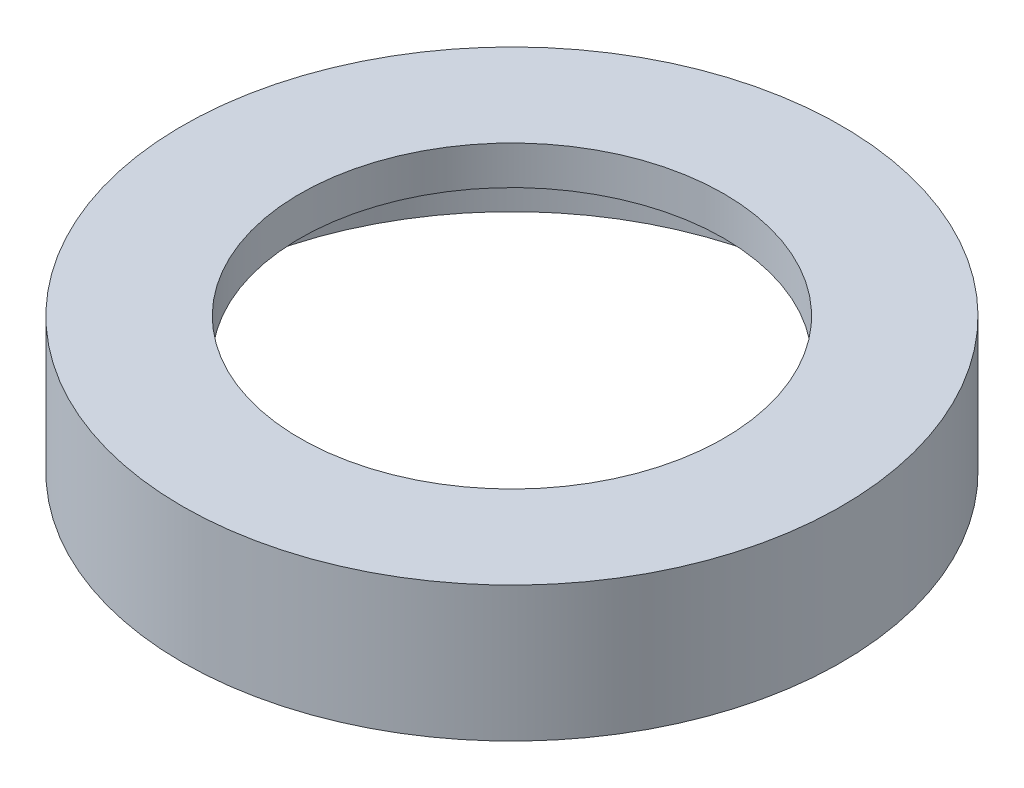
ISO-10303-21;
HEADER;
FILE_DESCRIPTION(('STEP AP214'),'2;1');
FILE_NAME('part.step','',(''),(''),'','','');
FILE_SCHEMA(('AUTOMOTIVE_DESIGN { 1 0 10303 214 1 1 1 1 }'));
ENDSEC;
DATA;
#1=APPLICATION_CONTEXT('core data for automotive mechanical design processes');
#2=APPLICATION_PROTOCOL_DEFINITION('international standard','automotive_design',2000,#1);
#3=PRODUCT_CONTEXT('',#1,'mechanical');
#4=PRODUCT('Part','Part','',(#3));
#5=PRODUCT_RELATED_PRODUCT_CATEGORY('part','',(#4));
#6=PRODUCT_DEFINITION_FORMATION('','',#4);
#7=PRODUCT_DEFINITION_CONTEXT('part definition',#1,'design');
#8=PRODUCT_DEFINITION('design','',#6,#7);
#9=PRODUCT_DEFINITION_SHAPE('','',#8);
#10=(LENGTH_UNIT() NAMED_UNIT(*) SI_UNIT(.MILLI.,.METRE.));
#11=(NAMED_UNIT(*) PLANE_ANGLE_UNIT() SI_UNIT($,.RADIAN.));
#12=(NAMED_UNIT(*) SI_UNIT($,.STERADIAN.) SOLID_ANGLE_UNIT());
#13=UNCERTAINTY_MEASURE_WITH_UNIT(LENGTH_MEASURE(1.E-05),#10,'distance_accuracy_value','');
#14=(GEOMETRIC_REPRESENTATION_CONTEXT(3) GLOBAL_UNCERTAINTY_ASSIGNED_CONTEXT((#13)) GLOBAL_UNIT_ASSIGNED_CONTEXT((#10,
#11,#12)) REPRESENTATION_CONTEXT('',''));
#15=CARTESIAN_POINT('',(0.,0.,0.));
#16=DIRECTION('',(0.,0.,1.));
#17=DIRECTION('',(1.,0.,0.));
#18=AXIS2_PLACEMENT_3D('',#15,#16,#17);
#19=CARTESIAN_POINT('',(0.,6.,0.));
#20=DIRECTION('',(0.,-1.,0.));
#21=DIRECTION('',(0.,0.,-1.));
#22=AXIS2_PLACEMENT_3D('',#19,#20,#21);
#23=PLANE('',#22);
#24=CARTESIAN_POINT('',(0.,6.,0.));
#25=DIRECTION('',(0.,-1.,0.));
#26=DIRECTION('',(0.,0.,-1.));
#27=AXIS2_PLACEMENT_3D('',#24,#25,#26);
#28=CIRCLE('',#27,16.523562211413);
#29=CARTESIAN_POINT('',(0.,6.,-16.523562211413));
#30=VERTEX_POINT('',#29);
#31=EDGE_CURVE('E102',#30,#30,#28,.T.);
#32=ORIENTED_EDGE('',*,*,#31,.T.);
#33=EDGE_LOOP('',(#32));
#34=FACE_BOUND('',#33,.T.);
#35=CARTESIAN_POINT('',(0.,6.,0.));
#36=DIRECTION('',(0.,-1.,0.));
#37=DIRECTION('',(0.,0.,-1.));
#38=AXIS2_PLACEMENT_3D('',#35,#36,#37);
#39=CIRCLE('',#38,11.5214767276703);
#40=CARTESIAN_POINT('',(0.,6.,-11.5214767276703));
#41=VERTEX_POINT('',#40);
#42=EDGE_CURVE('E113',#41,#41,#39,.T.);
#43=ORIENTED_EDGE('',*,*,#42,.F.);
#44=EDGE_LOOP('',(#43));
#45=FACE_BOUND('',#44,.T.);
#46=ADVANCED_FACE('F91',(#34,#45),#23,.T.);
#47=CARTESIAN_POINT('',(0.,7.,0.));
#48=DIRECTION('',(0.,1.,0.));
#49=DIRECTION('',(0.,0.,1.));
#50=AXIS2_PLACEMENT_3D('',#47,#48,#49);
#51=PLANE('',#50);
#52=CARTESIAN_POINT('',(0.,7.,0.));
#53=DIRECTION('',(0.,-1.,0.));
#54=DIRECTION('',(0.,0.,-1.));
#55=AXIS2_PLACEMENT_3D('',#52,#53,#54);
#56=CIRCLE('',#55,10.9793647863693);
#57=CARTESIAN_POINT('',(0.,7.,-10.9793647863693));
#58=VERTEX_POINT('',#57);
#59=EDGE_CURVE('E107',#58,#58,#56,.T.);
#60=ORIENTED_EDGE('',*,*,#59,.T.);
#61=EDGE_LOOP('',(#60));
#62=FACE_BOUND('',#61,.T.);
#63=CARTESIAN_POINT('',(0.,7.,0.));
#64=DIRECTION('',(0.,1.,0.));
#65=DIRECTION('',(0.,0.,1.));
#66=AXIS2_PLACEMENT_3D('',#63,#64,#65);
#67=CIRCLE('',#66,17.0749365141425);
#68=CARTESIAN_POINT('',(0.,7.,17.0749365141425));
#69=VERTEX_POINT('',#68);
#70=EDGE_CURVE('E11',#69,#69,#67,.T.);
#71=ORIENTED_EDGE('',*,*,#70,.T.);
#72=EDGE_LOOP('',(#71));
#73=FACE_BOUND('',#72,.T.);
#74=ADVANCED_FACE('F139',(#62,#73),#51,.T.);
#75=CARTESIAN_POINT('',(0.,0.,0.));
#76=DIRECTION('',(0.,1.,0.));
#77=DIRECTION('',(0.,0.,1.));
#78=AXIS2_PLACEMENT_3D('',#75,#76,#77);
#79=PLANE('',#78);
#80=CARTESIAN_POINT('',(0.,0.,0.));
#81=DIRECTION('',(0.,-1.,0.));
#82=DIRECTION('',(0.,0.,-1.));
#83=AXIS2_PLACEMENT_3D('',#80,#81,#82);
#84=CIRCLE('',#83,16.523562211413);
#85=CARTESIAN_POINT('',(0.,0.,-16.523562211413));
#86=VERTEX_POINT('',#85);
#87=EDGE_CURVE('E104',#86,#86,#84,.T.);
#88=ORIENTED_EDGE('',*,*,#87,.F.);
#89=EDGE_LOOP('',(#88));
#90=FACE_BOUND('',#89,.T.);
#91=CARTESIAN_POINT('',(0.,0.,0.));
#92=DIRECTION('',(0.,1.,0.));
#93=DIRECTION('',(0.,0.,1.));
#94=AXIS2_PLACEMENT_3D('',#91,#92,#93);
#95=CIRCLE('',#94,17.0749365141425);
#96=CARTESIAN_POINT('',(0.,0.,17.0749365141425));
#97=VERTEX_POINT('',#96);
#98=EDGE_CURVE('E95',#97,#97,#95,.T.);
#99=ORIENTED_EDGE('',*,*,#98,.F.);
#100=EDGE_LOOP('',(#99));
#101=FACE_BOUND('',#100,.T.);
#102=ADVANCED_FACE('F145',(#90,#101),#79,.F.);
#103=CARTESIAN_POINT('',(0.,7.,0.));
#104=DIRECTION('',(0.,-1.,0.));
#105=DIRECTION('',(0.,0.,-1.));
#106=AXIS2_PLACEMENT_3D('',#103,#104,#105);
#107=CYLINDRICAL_SURFACE('',#106,17.0749365141425);
#108=ORIENTED_EDGE('',*,*,#70,.F.);
#109=EDGE_LOOP('',(#108));
#110=FACE_BOUND('',#109,.T.);
#111=ORIENTED_EDGE('',*,*,#98,.T.);
#112=EDGE_LOOP('',(#111));
#113=FACE_BOUND('',#112,.T.);
#114=ADVANCED_FACE('F93',(#110,#113),#107,.T.);
#115=CARTESIAN_POINT('',(0.,6.,0.));
#116=DIRECTION('',(0.,-1.,0.));
#117=DIRECTION('',(0.,0.,-1.));
#118=AXIS2_PLACEMENT_3D('',#115,#116,#117);
#119=CYLINDRICAL_SURFACE('',#118,16.523562211413);
#120=ORIENTED_EDGE('',*,*,#31,.F.);
#121=EDGE_LOOP('',(#120));
#122=FACE_BOUND('',#121,.T.);
#123=ORIENTED_EDGE('',*,*,#87,.T.);
#124=EDGE_LOOP('',(#123));
#125=FACE_BOUND('',#124,.T.);
#126=ADVANCED_FACE('F135',(#122,#125),#119,.F.);
#127=CARTESIAN_POINT('',(0.,7.,0.));
#128=DIRECTION('',(0.,-1.,0.));
#129=DIRECTION('',(0.,0.,-1.));
#130=AXIS2_PLACEMENT_3D('',#127,#128,#129);
#131=CYLINDRICAL_SURFACE('',#130,10.9793647863693);
#132=ORIENTED_EDGE('',*,*,#59,.F.);
#133=EDGE_LOOP('',(#132));
#134=FACE_BOUND('',#133,.T.);
#135=CARTESIAN_POINT('',(0.,5.,0.));
#136=DIRECTION('',(0.,-1.,0.));
#137=DIRECTION('',(0.,0.,-1.));
#138=AXIS2_PLACEMENT_3D('',#135,#136,#137);
#139=CIRCLE('',#138,10.9793647863693);
#140=CARTESIAN_POINT('',(0.,5.,-10.9793647863693));
#141=VERTEX_POINT('',#140);
#142=EDGE_CURVE('E116',#141,#141,#139,.T.);
#143=ORIENTED_EDGE('',*,*,#142,.T.);
#144=EDGE_LOOP('',(#143));
#145=FACE_BOUND('',#144,.T.);
#146=ADVANCED_FACE('F122',(#134,#145),#131,.F.);
#147=CARTESIAN_POINT('',(0.,5.,0.));
#148=DIRECTION('',(0.,-1.,0.));
#149=DIRECTION('',(0.,0.,-1.));
#150=AXIS2_PLACEMENT_3D('',#147,#148,#149);
#151=PLANE('',#150);
#152=CARTESIAN_POINT('',(0.,5.,0.));
#153=DIRECTION('',(0.,-1.,0.));
#154=DIRECTION('',(0.,0.,-1.));
#155=AXIS2_PLACEMENT_3D('',#152,#153,#154);
#156=CIRCLE('',#155,11.5214767276703);
#157=CARTESIAN_POINT('',(0.,5.,-11.5214767276703));
#158=VERTEX_POINT('',#157);
#159=EDGE_CURVE('E112',#158,#158,#156,.T.);
#160=ORIENTED_EDGE('',*,*,#159,.T.);
#161=EDGE_LOOP('',(#160));
#162=FACE_BOUND('',#161,.T.);
#163=ORIENTED_EDGE('',*,*,#142,.F.);
#164=EDGE_LOOP('',(#163));
#165=FACE_BOUND('',#164,.T.);
#166=ADVANCED_FACE('F124',(#162,#165),#151,.T.);
#167=CARTESIAN_POINT('',(0.,5.,0.));
#168=DIRECTION('',(0.,1.,0.));
#169=DIRECTION('',(0.,0.,1.));
#170=AXIS2_PLACEMENT_3D('',#167,#168,#169);
#171=CYLINDRICAL_SURFACE('',#170,11.5214767276703);
#172=ORIENTED_EDGE('',*,*,#159,.F.);
#173=EDGE_LOOP('',(#172));
#174=FACE_BOUND('',#173,.T.);
#175=ORIENTED_EDGE('',*,*,#42,.T.);
#176=EDGE_LOOP('',(#175));
#177=FACE_BOUND('',#176,.T.);
#178=ADVANCED_FACE('F126',(#174,#177),#171,.T.);
#179=CLOSED_SHELL('',(#46,#74,#102,#114,#126,#146,#166,#178));
#180=MANIFOLD_SOLID_BREP('B2',#179);
#181=ADVANCED_BREP_SHAPE_REPRESENTATION('',(#18,#180),#14);
#182=SHAPE_DEFINITION_REPRESENTATION(#9,#181);
ENDSEC;
END-ISO-10303-21;
